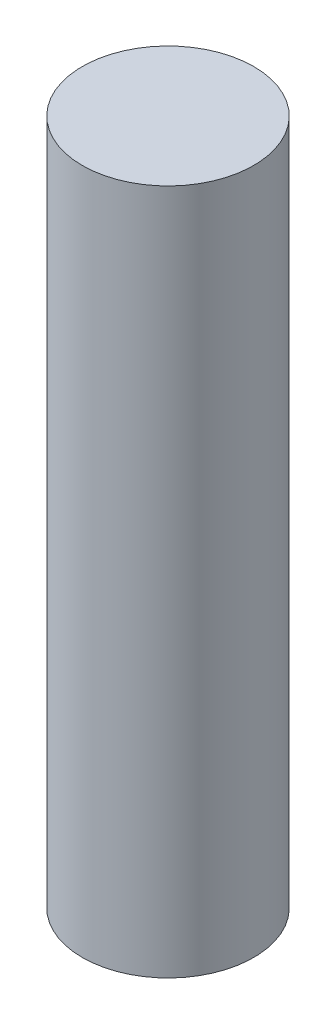
ISO-10303-21;
HEADER;
FILE_DESCRIPTION(('STEP AP214'),'2;1');
FILE_NAME('part.step','',(''),(''),'','','');
FILE_SCHEMA(('AUTOMOTIVE_DESIGN { 1 0 10303 214 1 1 1 1 }'));
ENDSEC;
DATA;
#1=APPLICATION_CONTEXT('core data for automotive mechanical design processes');
#2=APPLICATION_PROTOCOL_DEFINITION('international standard','automotive_design',2000,#1);
#3=PRODUCT_CONTEXT('',#1,'mechanical');
#4=PRODUCT('Part','Part','',(#3));
#5=PRODUCT_RELATED_PRODUCT_CATEGORY('part','',(#4));
#6=PRODUCT_DEFINITION_FORMATION('','',#4);
#7=PRODUCT_DEFINITION_CONTEXT('part definition',#1,'design');
#8=PRODUCT_DEFINITION('design','',#6,#7);
#9=PRODUCT_DEFINITION_SHAPE('','',#8);
#10=(LENGTH_UNIT() NAMED_UNIT(*) SI_UNIT(.MILLI.,.METRE.));
#11=(NAMED_UNIT(*) PLANE_ANGLE_UNIT() SI_UNIT($,.RADIAN.));
#12=(NAMED_UNIT(*) SI_UNIT($,.STERADIAN.) SOLID_ANGLE_UNIT());
#13=UNCERTAINTY_MEASURE_WITH_UNIT(LENGTH_MEASURE(1.E-05),#10,'distance_accuracy_value','');
#14=(GEOMETRIC_REPRESENTATION_CONTEXT(3) GLOBAL_UNCERTAINTY_ASSIGNED_CONTEXT((#13)) GLOBAL_UNIT_ASSIGNED_CONTEXT((#10,
#11,#12)) REPRESENTATION_CONTEXT('',''));
#15=CARTESIAN_POINT('',(0.,0.,0.));
#16=DIRECTION('',(0.,0.,1.));
#17=DIRECTION('',(1.,0.,0.));
#18=AXIS2_PLACEMENT_3D('',#15,#16,#17);
#19=CARTESIAN_POINT('',(0.,50.,0.));
#20=DIRECTION('',(0.,-1.,0.));
#21=DIRECTION('',(0.,0.,-1.));
#22=AXIS2_PLACEMENT_3D('',#19,#20,#21);
#23=CYLINDRICAL_SURFACE('',#22,6.25);
#24=CARTESIAN_POINT('',(0.,50.,0.));
#25=DIRECTION('',(0.,1.,0.));
#26=DIRECTION('',(0.,0.,1.));
#27=AXIS2_PLACEMENT_3D('',#24,#25,#26);
#28=CIRCLE('',#27,6.25);
#29=CARTESIAN_POINT('',(0.,50.,6.25));
#30=VERTEX_POINT('',#29);
#31=EDGE_CURVE('E10',#30,#30,#28,.T.);
#32=ORIENTED_EDGE('',*,*,#31,.F.);
#33=EDGE_LOOP('',(#32));
#34=FACE_BOUND('',#33,.T.);
#35=CARTESIAN_POINT('',(0.,0.,0.));
#36=DIRECTION('',(0.,1.,0.));
#37=DIRECTION('',(0.,0.,1.));
#38=AXIS2_PLACEMENT_3D('',#35,#36,#37);
#39=CIRCLE('',#38,6.25);
#40=CARTESIAN_POINT('',(0.,0.,6.25));
#41=VERTEX_POINT('',#40);
#42=EDGE_CURVE('E33',#41,#41,#39,.T.);
#43=ORIENTED_EDGE('',*,*,#42,.T.);
#44=EDGE_LOOP('',(#43));
#45=FACE_BOUND('',#44,.T.);
#46=ADVANCED_FACE('F30',(#34,#45),#23,.T.);
#47=CARTESIAN_POINT('',(0.,50.,0.));
#48=DIRECTION('',(0.,1.,0.));
#49=DIRECTION('',(0.,0.,1.));
#50=AXIS2_PLACEMENT_3D('',#47,#48,#49);
#51=PLANE('',#50);
#52=ORIENTED_EDGE('',*,*,#31,.T.);
#53=EDGE_LOOP('',(#52));
#54=FACE_BOUND('',#53,.T.);
#55=ADVANCED_FACE('F45',(#54),#51,.T.);
#56=CARTESIAN_POINT('',(0.,0.,0.));
#57=DIRECTION('',(0.,1.,0.));
#58=DIRECTION('',(0.,0.,1.));
#59=AXIS2_PLACEMENT_3D('',#56,#57,#58);
#60=PLANE('',#59);
#61=ORIENTED_EDGE('',*,*,#42,.F.);
#62=EDGE_LOOP('',(#61));
#63=FACE_BOUND('',#62,.T.);
#64=ADVANCED_FACE('F43',(#63),#60,.F.);
#65=CLOSED_SHELL('',(#46,#55,#64));
#66=MANIFOLD_SOLID_BREP('B2',#65);
#67=ADVANCED_BREP_SHAPE_REPRESENTATION('',(#18,#66),#14);
#68=SHAPE_DEFINITION_REPRESENTATION(#9,#67);
ENDSEC;
END-ISO-10303-21;
